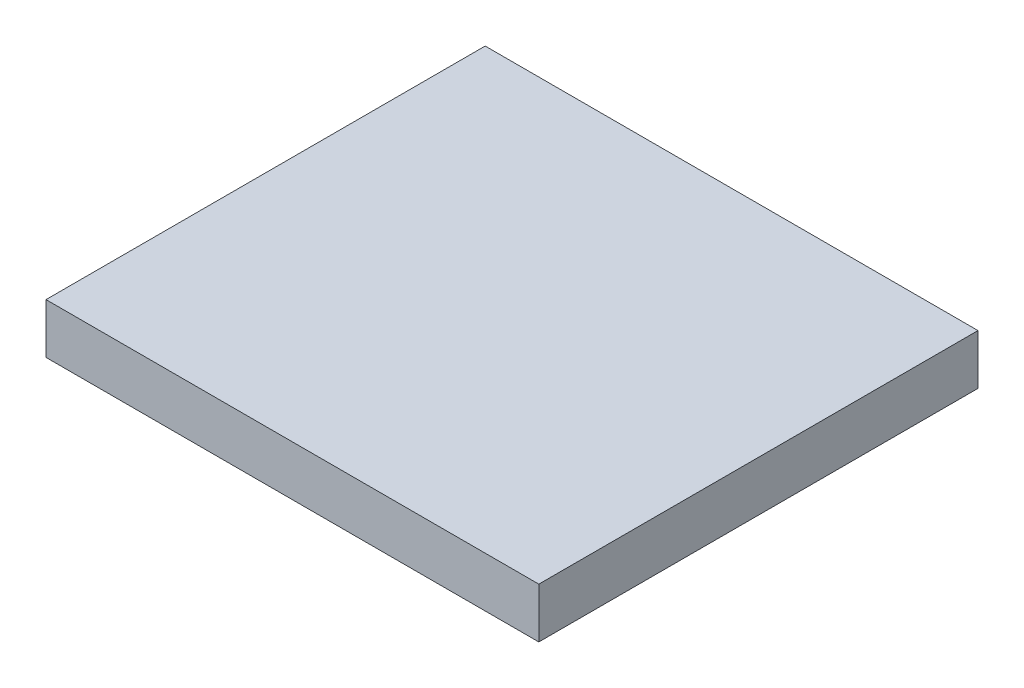
ISO-10303-21;
HEADER;
FILE_DESCRIPTION(('STEP AP214'),'2;1');
FILE_NAME('part.step','',(''),(''),'','','');
FILE_SCHEMA(('AUTOMOTIVE_DESIGN { 1 0 10303 214 1 1 1 1 }'));
ENDSEC;
DATA;
#1=APPLICATION_CONTEXT('core data for automotive mechanical design processes');
#2=APPLICATION_PROTOCOL_DEFINITION('international standard','automotive_design',2000,#1);
#3=PRODUCT_CONTEXT('',#1,'mechanical');
#4=PRODUCT('Part','Part','',(#3));
#5=PRODUCT_RELATED_PRODUCT_CATEGORY('part','',(#4));
#6=PRODUCT_DEFINITION_FORMATION('','',#4);
#7=PRODUCT_DEFINITION_CONTEXT('part definition',#1,'design');
#8=PRODUCT_DEFINITION('design','',#6,#7);
#9=PRODUCT_DEFINITION_SHAPE('','',#8);
#10=(LENGTH_UNIT() NAMED_UNIT(*) SI_UNIT(.MILLI.,.METRE.));
#11=(NAMED_UNIT(*) PLANE_ANGLE_UNIT() SI_UNIT($,.RADIAN.));
#12=(NAMED_UNIT(*) SI_UNIT($,.STERADIAN.) SOLID_ANGLE_UNIT());
#13=UNCERTAINTY_MEASURE_WITH_UNIT(LENGTH_MEASURE(1.E-05),#10,'distance_accuracy_value','');
#14=(GEOMETRIC_REPRESENTATION_CONTEXT(3) GLOBAL_UNCERTAINTY_ASSIGNED_CONTEXT((#13)) GLOBAL_UNIT_ASSIGNED_CONTEXT((#10,
#11,#12)) REPRESENTATION_CONTEXT('',''));
#15=CARTESIAN_POINT('',(0.,0.,0.));
#16=DIRECTION('',(0.,0.,1.));
#17=DIRECTION('',(1.,0.,0.));
#18=AXIS2_PLACEMENT_3D('',#15,#16,#17);
#19=CARTESIAN_POINT('',(-1.66533453693773E-12,-1.49999999999872,4.44089209850063E-13));
#20=DIRECTION('',(1.40345746602276E-13,0.,0.999999999999986));
#21=DIRECTION('',(0.999999999999992,0.,-1.39161896106967E-13));
#22=AXIS2_PLACEMENT_3D('',#19,#20,#21);
#23=PLANE('',#22);
#24=DIRECTION('',(0.999999999999992,0.,-1.39161896106967E-13));
#25=VECTOR('',#24,1.);
#26=CARTESIAN_POINT('',(3.33066907387547E-13,8.88178419700125E-13,-1.11022302462516E-13));
#27=LINE('',#26,#25);
#28=CARTESIAN_POINT('',(3.33066907387547E-13,8.88178419700125E-13,-1.11022302462516E-13));
#29=VERTEX_POINT('',#28);
#30=CARTESIAN_POINT('',(14.75576731971,2.22044604925031E-13,-2.72004641033163E-12));
#31=VERTEX_POINT('',#30);
#32=EDGE_CURVE('E96',#29,#31,#27,.T.);
#33=ORIENTED_EDGE('',*,*,#32,.F.);
#34=DIRECTION('',(0.,1.,0.));
#35=VECTOR('',#34,1.);
#36=CARTESIAN_POINT('',(-1.66533453693773E-12,-1.49999999999872,4.44089209850063E-13));
#37=LINE('',#36,#35);
#38=CARTESIAN_POINT('',(-1.66533453693773E-12,-1.49999999999872,4.44089209850063E-13));
#39=VERTEX_POINT('',#38);
#40=EDGE_CURVE('E11',#39,#29,#37,.T.);
#41=ORIENTED_EDGE('',*,*,#40,.F.);
#42=DIRECTION('',(0.999999999999992,0.,-1.39161896106967E-13));
#43=VECTOR('',#42,1.);
#44=CARTESIAN_POINT('',(-1.66533453693773E-12,-1.49999999999872,4.44089209850063E-13));
#45=LINE('',#44,#43);
#46=CARTESIAN_POINT('',(14.755767319708,-1.49999999999717,-2.22044604925031E-12));
#47=VERTEX_POINT('',#46);
#48=EDGE_CURVE('E90',#39,#47,#45,.T.);
#49=ORIENTED_EDGE('',*,*,#48,.T.);
#50=DIRECTION('',(0.,1.,0.));
#51=VECTOR('',#50,1.);
#52=CARTESIAN_POINT('',(14.755767319708,-1.49999999999717,-2.22044604925031E-12));
#53=LINE('',#52,#51);
#54=EDGE_CURVE('E35',#47,#31,#53,.T.);
#55=ORIENTED_EDGE('',*,*,#54,.T.);
#56=EDGE_LOOP('',(#33,#41,#49,#55));
#57=FACE_BOUND('',#56,.T.);
#58=ADVANCED_FACE('F32',(#57),#23,.T.);
#59=CARTESIAN_POINT('',(-2.55351295663786E-12,-1.49999999999983,-13.149930718609));
#60=DIRECTION('',(-0.999999999999992,0.,0.));
#61=DIRECTION('',(0.,0.,0.999999999999986));
#62=AXIS2_PLACEMENT_3D('',#59,#60,#61);
#63=PLANE('',#62);
#64=DIRECTION('',(0.,0.,0.999999999999986));
#65=VECTOR('',#64,1.);
#66=CARTESIAN_POINT('',(3.33066907387547E-13,6.66133814775094E-13,-13.1499307186086));
#67=LINE('',#66,#65);
#68=CARTESIAN_POINT('',(3.33066907387547E-13,6.66133814775094E-13,-13.1499307186086));
#69=VERTEX_POINT('',#68);
#70=EDGE_CURVE('E92',#69,#29,#67,.T.);
#71=ORIENTED_EDGE('',*,*,#70,.F.);
#72=DIRECTION('',(0.,1.,0.));
#73=VECTOR('',#72,1.);
#74=CARTESIAN_POINT('',(-2.55351295663786E-12,-1.49999999999983,-13.149930718609));
#75=LINE('',#74,#73);
#76=CARTESIAN_POINT('',(-2.55351295663786E-12,-1.49999999999983,-13.149930718609));
#77=VERTEX_POINT('',#76);
#78=EDGE_CURVE('E41',#77,#69,#75,.T.);
#79=ORIENTED_EDGE('',*,*,#78,.F.);
#80=DIRECTION('',(0.,0.,0.999999999999986));
#81=VECTOR('',#80,1.);
#82=CARTESIAN_POINT('',(-2.55351295663786E-12,-1.49999999999983,-13.149930718609));
#83=LINE('',#82,#81);
#84=EDGE_CURVE('E87',#77,#39,#83,.T.);
#85=ORIENTED_EDGE('',*,*,#84,.T.);
#86=ORIENTED_EDGE('',*,*,#40,.T.);
#87=EDGE_LOOP('',(#71,#79,#85,#86));
#88=FACE_BOUND('',#87,.T.);
#89=ADVANCED_FACE('F106',(#88),#63,.T.);
#90=CARTESIAN_POINT('',(-2.55351295663786E-12,-1.49999999999983,-13.149930718609));
#91=DIRECTION('',(-1.40345746602276E-13,0.,-0.999999999999986));
#92=DIRECTION('',(-0.999999999999992,0.,1.39161896106967E-13));
#93=AXIS2_PLACEMENT_3D('',#90,#91,#92);
#94=PLANE('',#93);
#95=DIRECTION('',(-0.999999999999992,0.,1.39161896106967E-13));
#96=VECTOR('',#95,1.);
#97=CARTESIAN_POINT('',(3.33066907387547E-13,6.66133814775094E-13,-13.1499307186086));
#98=LINE('',#97,#96);
#99=CARTESIAN_POINT('',(14.75576731971,1.11022302462516E-12,-13.1499307186113));
#100=VERTEX_POINT('',#99);
#101=EDGE_CURVE('E82',#100,#69,#98,.T.);
#102=ORIENTED_EDGE('',*,*,#101,.F.);
#103=DIRECTION('',(0.,1.,0.));
#104=VECTOR('',#103,1.);
#105=CARTESIAN_POINT('',(14.7557673197071,-1.49999999999828,-13.1499307186119));
#106=LINE('',#105,#104);
#107=CARTESIAN_POINT('',(14.7557673197071,-1.49999999999828,-13.1499307186119));
#108=VERTEX_POINT('',#107);
#109=EDGE_CURVE('E77',#108,#100,#106,.T.);
#110=ORIENTED_EDGE('',*,*,#109,.F.);
#111=DIRECTION('',(-0.999999999999992,0.,1.39161896106967E-13));
#112=VECTOR('',#111,1.);
#113=CARTESIAN_POINT('',(-2.55351295663786E-12,-1.49999999999983,-13.149930718609));
#114=LINE('',#113,#112);
#115=EDGE_CURVE('E80',#108,#77,#114,.T.);
#116=ORIENTED_EDGE('',*,*,#115,.T.);
#117=ORIENTED_EDGE('',*,*,#78,.T.);
#118=EDGE_LOOP('',(#102,#110,#116,#117));
#119=FACE_BOUND('',#118,.T.);
#120=ADVANCED_FACE('F79',(#119),#94,.T.);
#121=CARTESIAN_POINT('',(14.755767319708,-1.49999999999717,-2.22044604925031E-12));
#122=DIRECTION('',(0.999999999999992,0.,0.));
#123=DIRECTION('',(0.,0.,-0.999999999999986));
#124=AXIS2_PLACEMENT_3D('',#121,#122,#123);
#125=PLANE('',#124);
#126=DIRECTION('',(0.,0.,-0.999999999999986));
#127=VECTOR('',#126,1.);
#128=CARTESIAN_POINT('',(14.75576731971,2.22044604925031E-13,-2.72004641033163E-12));
#129=LINE('',#128,#127);
#130=EDGE_CURVE('E99',#31,#100,#129,.T.);
#131=ORIENTED_EDGE('',*,*,#130,.F.);
#132=ORIENTED_EDGE('',*,*,#54,.F.);
#133=DIRECTION('',(0.,0.,-0.999999999999986));
#134=VECTOR('',#133,1.);
#135=CARTESIAN_POINT('',(14.755767319708,-1.49999999999717,-2.22044604925031E-12));
#136=LINE('',#135,#134);
#137=EDGE_CURVE('E86',#47,#108,#136,.T.);
#138=ORIENTED_EDGE('',*,*,#137,.T.);
#139=ORIENTED_EDGE('',*,*,#109,.T.);
#140=EDGE_LOOP('',(#131,#132,#138,#139));
#141=FACE_BOUND('',#140,.T.);
#142=ADVANCED_FACE('F89',(#141),#125,.T.);
#143=CARTESIAN_POINT('',(-1.99840144432528E-12,-1.49999999999872,4.44089209850063E-13));
#144=DIRECTION('',(0.,1.,0.));
#145=DIRECTION('',(0.,0.,0.999999999999986));
#146=AXIS2_PLACEMENT_3D('',#143,#144,#145);
#147=PLANE('',#146);
#148=ORIENTED_EDGE('',*,*,#48,.F.);
#149=ORIENTED_EDGE('',*,*,#84,.F.);
#150=ORIENTED_EDGE('',*,*,#115,.F.);
#151=ORIENTED_EDGE('',*,*,#137,.F.);
#152=EDGE_LOOP('',(#148,#149,#150,#151));
#153=FACE_BOUND('',#152,.T.);
#154=ADVANCED_FACE('F85',(#153),#147,.F.);
#155=CARTESIAN_POINT('',(0.,0.,0.));
#156=DIRECTION('',(0.,1.,0.));
#157=DIRECTION('',(0.,0.,0.999999999999986));
#158=AXIS2_PLACEMENT_3D('',#155,#156,#157);
#159=PLANE('',#158);
#160=ORIENTED_EDGE('',*,*,#32,.T.);
#161=ORIENTED_EDGE('',*,*,#130,.T.);
#162=ORIENTED_EDGE('',*,*,#101,.T.);
#163=ORIENTED_EDGE('',*,*,#70,.T.);
#164=EDGE_LOOP('',(#160,#161,#162,#163));
#165=FACE_BOUND('',#164,.T.);
#166=ADVANCED_FACE('F105',(#165),#159,.T.);
#167=CLOSED_SHELL('',(#58,#89,#120,#142,#154,#166));
#168=MANIFOLD_SOLID_BREP('B2',#167);
#169=ADVANCED_BREP_SHAPE_REPRESENTATION('',(#18,#168),#14);
#170=SHAPE_DEFINITION_REPRESENTATION(#9,#169);
ENDSEC;
END-ISO-10303-21;
